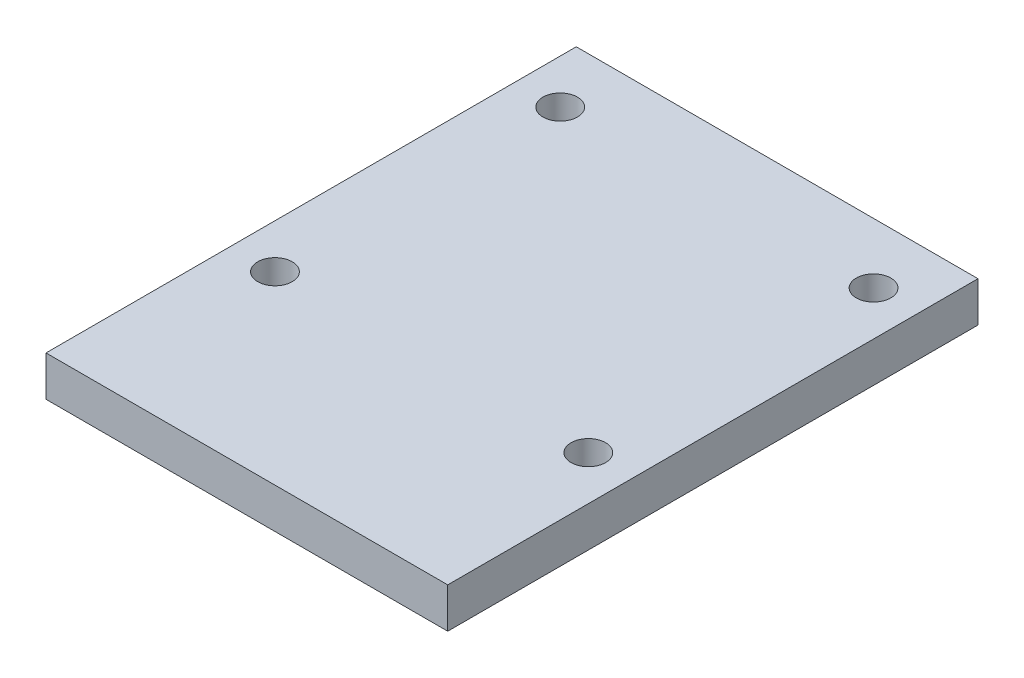
ISO-10303-21;
HEADER;
FILE_DESCRIPTION(('STEP AP214'),'2;1');
FILE_NAME('part.step','',(''),(''),'','','');
FILE_SCHEMA(('AUTOMOTIVE_DESIGN { 1 0 10303 214 1 1 1 1 }'));
ENDSEC;
DATA;
#1=APPLICATION_CONTEXT('core data for automotive mechanical design processes');
#2=APPLICATION_PROTOCOL_DEFINITION('international standard','automotive_design',2000,#1);
#3=PRODUCT_CONTEXT('',#1,'mechanical');
#4=PRODUCT('Part','Part','',(#3));
#5=PRODUCT_RELATED_PRODUCT_CATEGORY('part','',(#4));
#6=PRODUCT_DEFINITION_FORMATION('','',#4);
#7=PRODUCT_DEFINITION_CONTEXT('part definition',#1,'design');
#8=PRODUCT_DEFINITION('design','',#6,#7);
#9=PRODUCT_DEFINITION_SHAPE('','',#8);
#10=(LENGTH_UNIT() NAMED_UNIT(*) SI_UNIT(.MILLI.,.METRE.));
#11=(NAMED_UNIT(*) PLANE_ANGLE_UNIT() SI_UNIT($,.RADIAN.));
#12=(NAMED_UNIT(*) SI_UNIT($,.STERADIAN.) SOLID_ANGLE_UNIT());
#13=UNCERTAINTY_MEASURE_WITH_UNIT(LENGTH_MEASURE(1.E-05),#10,'distance_accuracy_value','');
#14=(GEOMETRIC_REPRESENTATION_CONTEXT(3) GLOBAL_UNCERTAINTY_ASSIGNED_CONTEXT((#13)) GLOBAL_UNIT_ASSIGNED_CONTEXT((#10,
#11,#12)) REPRESENTATION_CONTEXT('',''));
#15=CARTESIAN_POINT('',(0.,0.,0.));
#16=DIRECTION('',(0.,0.,1.));
#17=DIRECTION('',(1.,0.,0.));
#18=AXIS2_PLACEMENT_3D('',#15,#16,#17);
#19=CARTESIAN_POINT('',(-31.,-5.,10.));
#20=DIRECTION('',(0.,-1.,0.));
#21=DIRECTION('',(0.,0.,1.));
#22=AXIS2_PLACEMENT_3D('',#19,#20,#21);
#23=CYLINDRICAL_SURFACE('',#22,2.15);
#24=CARTESIAN_POINT('',(-31.,-5.,10.));
#25=DIRECTION('',(0.,1.,0.));
#26=DIRECTION('',(1.,0.,0.));
#27=AXIS2_PLACEMENT_3D('',#24,#25,#26);
#28=CIRCLE('',#27,2.15);
#29=CARTESIAN_POINT('',(-28.85,-5.,10.));
#30=VERTEX_POINT('',#29);
#31=EDGE_CURVE('E94',#30,#30,#28,.T.);
#32=ORIENTED_EDGE('',*,*,#31,.F.);
#33=EDGE_LOOP('',(#32));
#34=FACE_BOUND('',#33,.T.);
#35=CARTESIAN_POINT('',(-31.,0.,10.));
#36=DIRECTION('',(0.,1.,0.));
#37=DIRECTION('',(1.,0.,0.));
#38=AXIS2_PLACEMENT_3D('',#35,#36,#37);
#39=CIRCLE('',#38,2.15);
#40=CARTESIAN_POINT('',(-28.85,0.,10.));
#41=VERTEX_POINT('',#40);
#42=EDGE_CURVE('E90',#41,#41,#39,.T.);
#43=ORIENTED_EDGE('',*,*,#42,.T.);
#44=EDGE_LOOP('',(#43));
#45=FACE_BOUND('',#44,.T.);
#46=ADVANCED_FACE('F40',(#34,#45),#23,.F.);
#47=CARTESIAN_POINT('',(8.,-5.,-25.5));
#48=DIRECTION('',(0.,-1.,0.));
#49=DIRECTION('',(0.,0.,1.));
#50=AXIS2_PLACEMENT_3D('',#47,#48,#49);
#51=CYLINDRICAL_SURFACE('',#50,2.15);
#52=CARTESIAN_POINT('',(8.,-5.,-25.5));
#53=DIRECTION('',(0.,1.,0.));
#54=DIRECTION('',(1.,0.,0.));
#55=AXIS2_PLACEMENT_3D('',#52,#53,#54);
#56=CIRCLE('',#55,2.15);
#57=CARTESIAN_POINT('',(10.15,-5.,-25.5));
#58=VERTEX_POINT('',#57);
#59=EDGE_CURVE('E50',#58,#58,#56,.T.);
#60=ORIENTED_EDGE('',*,*,#59,.F.);
#61=EDGE_LOOP('',(#60));
#62=FACE_BOUND('',#61,.T.);
#63=CARTESIAN_POINT('',(8.,0.,-25.5));
#64=DIRECTION('',(0.,1.,0.));
#65=DIRECTION('',(1.,0.,0.));
#66=AXIS2_PLACEMENT_3D('',#63,#64,#65);
#67=CIRCLE('',#66,2.15);
#68=CARTESIAN_POINT('',(10.15,0.,-25.5));
#69=VERTEX_POINT('',#68);
#70=EDGE_CURVE('E92',#69,#69,#67,.T.);
#71=ORIENTED_EDGE('',*,*,#70,.T.);
#72=EDGE_LOOP('',(#71));
#73=FACE_BOUND('',#72,.T.);
#74=ADVANCED_FACE('F173',(#62,#73),#51,.F.);
#75=CARTESIAN_POINT('',(-31.,-5.,-25.5));
#76=DIRECTION('',(0.,-1.,0.));
#77=DIRECTION('',(0.,0.,1.));
#78=AXIS2_PLACEMENT_3D('',#75,#76,#77);
#79=CYLINDRICAL_SURFACE('',#78,2.15);
#80=CARTESIAN_POINT('',(-31.,-5.,-25.5));
#81=DIRECTION('',(0.,1.,0.));
#82=DIRECTION('',(1.,0.,0.));
#83=AXIS2_PLACEMENT_3D('',#80,#81,#82);
#84=CIRCLE('',#83,2.15);
#85=CARTESIAN_POINT('',(-28.85,-5.,-25.5));
#86=VERTEX_POINT('',#85);
#87=EDGE_CURVE('E12',#86,#86,#84,.T.);
#88=ORIENTED_EDGE('',*,*,#87,.F.);
#89=EDGE_LOOP('',(#88));
#90=FACE_BOUND('',#89,.T.);
#91=CARTESIAN_POINT('',(-31.,0.,-25.5));
#92=DIRECTION('',(0.,1.,0.));
#93=DIRECTION('',(1.,0.,0.));
#94=AXIS2_PLACEMENT_3D('',#91,#92,#93);
#95=CIRCLE('',#94,2.15);
#96=CARTESIAN_POINT('',(-28.85,0.,-25.5));
#97=VERTEX_POINT('',#96);
#98=EDGE_CURVE('E97',#97,#97,#95,.T.);
#99=ORIENTED_EDGE('',*,*,#98,.T.);
#100=EDGE_LOOP('',(#99));
#101=FACE_BOUND('',#100,.T.);
#102=ADVANCED_FACE('F178',(#90,#101),#79,.F.);
#103=CARTESIAN_POINT('',(0.,-5.,0.));
#104=DIRECTION('',(0.,1.,0.));
#105=DIRECTION('',(1.,0.,0.));
#106=AXIS2_PLACEMENT_3D('',#103,#104,#105);
#107=PLANE('',#106);
#108=ORIENTED_EDGE('',*,*,#87,.T.);
#109=EDGE_LOOP('',(#108));
#110=FACE_BOUND('',#109,.T.);
#111=ORIENTED_EDGE('',*,*,#59,.T.);
#112=EDGE_LOOP('',(#111));
#113=FACE_BOUND('',#112,.T.);
#114=ORIENTED_EDGE('',*,*,#31,.T.);
#115=EDGE_LOOP('',(#114));
#116=FACE_BOUND('',#115,.T.);
#117=CARTESIAN_POINT('',(8.,-5.,10.));
#118=DIRECTION('',(0.,1.,0.));
#119=DIRECTION('',(1.,0.,0.));
#120=AXIS2_PLACEMENT_3D('',#117,#118,#119);
#121=CIRCLE('',#120,2.15);
#122=CARTESIAN_POINT('',(10.15,-5.,10.));
#123=VERTEX_POINT('',#122);
#124=EDGE_CURVE('E78',#123,#123,#121,.T.);
#125=ORIENTED_EDGE('',*,*,#124,.T.);
#126=EDGE_LOOP('',(#125));
#127=FACE_BOUND('',#126,.T.);
#128=DIRECTION('',(0.,0.,1.));
#129=VECTOR('',#128,1.);
#130=CARTESIAN_POINT('',(-36.5,-5.,-33.));
#131=LINE('',#130,#129);
#132=CARTESIAN_POINT('',(-36.5,-5.,-33.));
#133=VERTEX_POINT('',#132);
#134=CARTESIAN_POINT('',(-36.5,-5.,33.));
#135=VERTEX_POINT('',#134);
#136=EDGE_CURVE('E101',#133,#135,#131,.T.);
#137=ORIENTED_EDGE('',*,*,#136,.F.);
#138=DIRECTION('',(-1.,0.,0.));
#139=VECTOR('',#138,1.);
#140=CARTESIAN_POINT('',(13.5,-5.,-33.));
#141=LINE('',#140,#139);
#142=CARTESIAN_POINT('',(13.5,-5.,-33.));
#143=VERTEX_POINT('',#142);
#144=EDGE_CURVE('E96',#143,#133,#141,.T.);
#145=ORIENTED_EDGE('',*,*,#144,.F.);
#146=DIRECTION('',(0.,0.,-1.));
#147=VECTOR('',#146,1.);
#148=CARTESIAN_POINT('',(13.5,-5.,33.));
#149=LINE('',#148,#147);
#150=CARTESIAN_POINT('',(13.5,-5.,33.));
#151=VERTEX_POINT('',#150);
#152=EDGE_CURVE('E124',#151,#143,#149,.T.);
#153=ORIENTED_EDGE('',*,*,#152,.F.);
#154=DIRECTION('',(1.,0.,0.));
#155=VECTOR('',#154,1.);
#156=CARTESIAN_POINT('',(-13.5,-5.,33.));
#157=LINE('',#156,#155);
#158=EDGE_CURVE('E106',#135,#151,#157,.T.);
#159=ORIENTED_EDGE('',*,*,#158,.F.);
#160=EDGE_LOOP('',(#137,#145,#153,#159));
#161=FACE_BOUND('',#160,.T.);
#162=ADVANCED_FACE('F160',(#110,#113,#116,#127,#161),#107,.F.);
#163=CARTESIAN_POINT('',(13.5,-5.,-33.));
#164=DIRECTION('',(0.,0.,-1.));
#165=DIRECTION('',(0.,-1.,0.));
#166=AXIS2_PLACEMENT_3D('',#163,#164,#165);
#167=PLANE('',#166);
#168=DIRECTION('',(-1.,0.,0.));
#169=VECTOR('',#168,1.);
#170=CARTESIAN_POINT('',(13.5,0.,-33.));
#171=LINE('',#170,#169);
#172=CARTESIAN_POINT('',(13.5,0.,-33.));
#173=VERTEX_POINT('',#172);
#174=CARTESIAN_POINT('',(-36.5,0.,-33.));
#175=VERTEX_POINT('',#174);
#176=EDGE_CURVE('E93',#173,#175,#171,.T.);
#177=ORIENTED_EDGE('',*,*,#176,.F.);
#178=DIRECTION('',(0.,1.,0.));
#179=VECTOR('',#178,1.);
#180=CARTESIAN_POINT('',(13.5,-5.,-33.));
#181=LINE('',#180,#179);
#182=EDGE_CURVE('E113',#143,#173,#181,.T.);
#183=ORIENTED_EDGE('',*,*,#182,.F.);
#184=ORIENTED_EDGE('',*,*,#144,.T.);
#185=DIRECTION('',(0.,1.,0.));
#186=VECTOR('',#185,1.);
#187=CARTESIAN_POINT('',(-36.5,-5.,-33.));
#188=LINE('',#187,#186);
#189=EDGE_CURVE('E98',#133,#175,#188,.T.);
#190=ORIENTED_EDGE('',*,*,#189,.T.);
#191=EDGE_LOOP('',(#177,#183,#184,#190));
#192=FACE_BOUND('',#191,.T.);
#193=ADVANCED_FACE('F140',(#192),#167,.T.);
#194=CARTESIAN_POINT('',(13.5,-5.,33.));
#195=DIRECTION('',(1.,0.,0.));
#196=DIRECTION('',(0.,0.,1.));
#197=AXIS2_PLACEMENT_3D('',#194,#195,#196);
#198=PLANE('',#197);
#199=DIRECTION('',(0.,0.,-1.));
#200=VECTOR('',#199,1.);
#201=CARTESIAN_POINT('',(13.5,0.,33.));
#202=LINE('',#201,#200);
#203=CARTESIAN_POINT('',(13.5,0.,33.));
#204=VERTEX_POINT('',#203);
#205=EDGE_CURVE('E117',#204,#173,#202,.T.);
#206=ORIENTED_EDGE('',*,*,#205,.F.);
#207=DIRECTION('',(0.,1.,0.));
#208=VECTOR('',#207,1.);
#209=CARTESIAN_POINT('',(13.5,-5.,33.));
#210=LINE('',#209,#208);
#211=EDGE_CURVE('E110',#151,#204,#210,.T.);
#212=ORIENTED_EDGE('',*,*,#211,.F.);
#213=ORIENTED_EDGE('',*,*,#152,.T.);
#214=ORIENTED_EDGE('',*,*,#182,.T.);
#215=EDGE_LOOP('',(#206,#212,#213,#214));
#216=FACE_BOUND('',#215,.T.);
#217=ADVANCED_FACE('F134',(#216),#198,.T.);
#218=CARTESIAN_POINT('',(-13.5,-5.,33.));
#219=DIRECTION('',(0.,0.,1.));
#220=DIRECTION('',(1.,0.,0.));
#221=AXIS2_PLACEMENT_3D('',#218,#219,#220);
#222=PLANE('',#221);
#223=DIRECTION('',(1.,0.,0.));
#224=VECTOR('',#223,1.);
#225=CARTESIAN_POINT('',(-13.5,0.,33.));
#226=LINE('',#225,#224);
#227=CARTESIAN_POINT('',(-36.5,0.,33.));
#228=VERTEX_POINT('',#227);
#229=EDGE_CURVE('E87',#228,#204,#226,.T.);
#230=ORIENTED_EDGE('',*,*,#229,.F.);
#231=DIRECTION('',(0.,1.,0.));
#232=VECTOR('',#231,1.);
#233=CARTESIAN_POINT('',(-36.5,-5.,33.));
#234=LINE('',#233,#232);
#235=EDGE_CURVE('E104',#135,#228,#234,.T.);
#236=ORIENTED_EDGE('',*,*,#235,.F.);
#237=ORIENTED_EDGE('',*,*,#158,.T.);
#238=ORIENTED_EDGE('',*,*,#211,.T.);
#239=EDGE_LOOP('',(#230,#236,#237,#238));
#240=FACE_BOUND('',#239,.T.);
#241=ADVANCED_FACE('F149',(#240),#222,.T.);
#242=CARTESIAN_POINT('',(-36.5,-5.,-33.));
#243=DIRECTION('',(-1.,0.,0.));
#244=DIRECTION('',(0.,0.,1.));
#245=AXIS2_PLACEMENT_3D('',#242,#243,#244);
#246=PLANE('',#245);
#247=DIRECTION('',(0.,0.,1.));
#248=VECTOR('',#247,1.);
#249=CARTESIAN_POINT('',(-36.5,0.,-33.));
#250=LINE('',#249,#248);
#251=EDGE_CURVE('E85',#175,#228,#250,.T.);
#252=ORIENTED_EDGE('',*,*,#251,.F.);
#253=ORIENTED_EDGE('',*,*,#189,.F.);
#254=ORIENTED_EDGE('',*,*,#136,.T.);
#255=ORIENTED_EDGE('',*,*,#235,.T.);
#256=EDGE_LOOP('',(#252,#253,#254,#255));
#257=FACE_BOUND('',#256,.T.);
#258=ADVANCED_FACE('F161',(#257),#246,.T.);
#259=CARTESIAN_POINT('',(0.,0.,0.));
#260=DIRECTION('',(0.,1.,0.));
#261=DIRECTION('',(1.,0.,0.));
#262=AXIS2_PLACEMENT_3D('',#259,#260,#261);
#263=PLANE('',#262);
#264=ORIENTED_EDGE('',*,*,#98,.F.);
#265=EDGE_LOOP('',(#264));
#266=FACE_BOUND('',#265,.T.);
#267=ORIENTED_EDGE('',*,*,#70,.F.);
#268=EDGE_LOOP('',(#267));
#269=FACE_BOUND('',#268,.T.);
#270=ORIENTED_EDGE('',*,*,#42,.F.);
#271=EDGE_LOOP('',(#270));
#272=FACE_BOUND('',#271,.T.);
#273=CARTESIAN_POINT('',(8.,0.,10.));
#274=DIRECTION('',(0.,1.,0.));
#275=DIRECTION('',(1.,0.,0.));
#276=AXIS2_PLACEMENT_3D('',#273,#274,#275);
#277=CIRCLE('',#276,2.15);
#278=CARTESIAN_POINT('',(10.15,0.,10.));
#279=VERTEX_POINT('',#278);
#280=EDGE_CURVE('E44',#279,#279,#277,.T.);
#281=ORIENTED_EDGE('',*,*,#280,.F.);
#282=EDGE_LOOP('',(#281));
#283=FACE_BOUND('',#282,.T.);
#284=ORIENTED_EDGE('',*,*,#251,.T.);
#285=ORIENTED_EDGE('',*,*,#229,.T.);
#286=ORIENTED_EDGE('',*,*,#205,.T.);
#287=ORIENTED_EDGE('',*,*,#176,.T.);
#288=EDGE_LOOP('',(#284,#285,#286,#287));
#289=FACE_BOUND('',#288,.T.);
#290=ADVANCED_FACE('F144',(#266,#269,#272,#283,#289),#263,.T.);
#291=CARTESIAN_POINT('',(8.,-5.,10.));
#292=DIRECTION('',(0.,-1.,0.));
#293=DIRECTION('',(0.,0.,1.));
#294=AXIS2_PLACEMENT_3D('',#291,#292,#293);
#295=CYLINDRICAL_SURFACE('',#294,2.15);
#296=ORIENTED_EDGE('',*,*,#124,.F.);
#297=EDGE_LOOP('',(#296));
#298=FACE_BOUND('',#297,.T.);
#299=ORIENTED_EDGE('',*,*,#280,.T.);
#300=EDGE_LOOP('',(#299));
#301=FACE_BOUND('',#300,.T.);
#302=ADVANCED_FACE('F42',(#298,#301),#295,.F.);
#303=CLOSED_SHELL('',(#46,#74,#102,#162,#193,#217,#241,#258,#290,#302));
#304=MANIFOLD_SOLID_BREP('B2',#303);
#305=ADVANCED_BREP_SHAPE_REPRESENTATION('',(#18,#304),#14);
#306=SHAPE_DEFINITION_REPRESENTATION(#9,#305);
ENDSEC;
END-ISO-10303-21;
